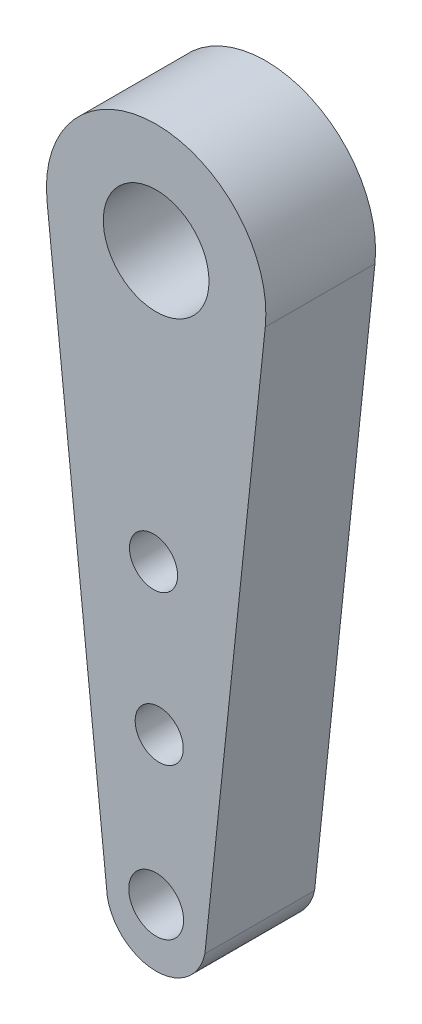
ISO-10303-21;
HEADER;
FILE_DESCRIPTION(('STEP AP214'),'2;1');
FILE_NAME('part.step','',(''),(''),'','','');
FILE_SCHEMA(('AUTOMOTIVE_DESIGN { 1 0 10303 214 1 1 1 1 }'));
ENDSEC;
DATA;
#1=APPLICATION_CONTEXT('core data for automotive mechanical design processes');
#2=APPLICATION_PROTOCOL_DEFINITION('international standard','automotive_design',2000,#1);
#3=PRODUCT_CONTEXT('',#1,'mechanical');
#4=PRODUCT('Part','Part','',(#3));
#5=PRODUCT_RELATED_PRODUCT_CATEGORY('part','',(#4));
#6=PRODUCT_DEFINITION_FORMATION('','',#4);
#7=PRODUCT_DEFINITION_CONTEXT('part definition',#1,'design');
#8=PRODUCT_DEFINITION('design','',#6,#7);
#9=PRODUCT_DEFINITION_SHAPE('','',#8);
#10=(LENGTH_UNIT() NAMED_UNIT(*) SI_UNIT(.MILLI.,.METRE.));
#11=(NAMED_UNIT(*) PLANE_ANGLE_UNIT() SI_UNIT($,.RADIAN.));
#12=(NAMED_UNIT(*) SI_UNIT($,.STERADIAN.) SOLID_ANGLE_UNIT());
#13=UNCERTAINTY_MEASURE_WITH_UNIT(LENGTH_MEASURE(1.E-05),#10,'distance_accuracy_value','');
#14=(GEOMETRIC_REPRESENTATION_CONTEXT(3) GLOBAL_UNCERTAINTY_ASSIGNED_CONTEXT((#13)) GLOBAL_UNIT_ASSIGNED_CONTEXT((#10,
#11,#12)) REPRESENTATION_CONTEXT('',''));
#15=CARTESIAN_POINT('',(0.,0.,0.));
#16=DIRECTION('',(0.,0.,1.));
#17=DIRECTION('',(1.,0.,0.));
#18=AXIS2_PLACEMENT_3D('',#15,#16,#17);
#19=CARTESIAN_POINT('',(1.34674465498423,-9.11924863651487,3.));
#20=DIRECTION('',(0.,0.,-1.));
#21=DIRECTION('',(-1.,0.,0.));
#22=AXIS2_PLACEMENT_3D('',#19,#20,#21);
#23=CYLINDRICAL_SURFACE('',#22,1.36292129602079);
#24=CARTESIAN_POINT('',(1.34674465498423,-9.11924863651487,0.));
#25=DIRECTION('',(0.,0.,1.));
#26=DIRECTION('',(1.,0.,0.));
#27=AXIS2_PLACEMENT_3D('',#24,#25,#26);
#28=CIRCLE('',#27,1.36292129602079);
#29=CARTESIAN_POINT('',(2.67974354077018,-9.40327051884153,0.));
#30=VERTEX_POINT('',#29);
#31=CARTESIAN_POINT('',(0.0137457691982582,-9.40327051884147,0.));
#32=VERTEX_POINT('',#31);
#33=EDGE_CURVE('E111',#30,#32,#28,.F.);
#34=ORIENTED_EDGE('',*,*,#33,.F.);
#35=DIRECTION('',(0.,0.,-1.));
#36=VECTOR('',#35,1.);
#37=CARTESIAN_POINT('',(2.67974354077018,-9.40327051884153,3.));
#38=LINE('',#37,#36);
#39=CARTESIAN_POINT('',(2.67974354077018,-9.40327051884153,3.));
#40=VERTEX_POINT('',#39);
#41=EDGE_CURVE('E11',#40,#30,#38,.T.);
#42=ORIENTED_EDGE('',*,*,#41,.F.);
#43=CARTESIAN_POINT('',(1.34674465498423,-9.11924863651487,3.));
#44=DIRECTION('',(0.,0.,1.));
#45=DIRECTION('',(1.,0.,0.));
#46=AXIS2_PLACEMENT_3D('',#43,#44,#45);
#47=CIRCLE('',#46,1.36292129602079);
#48=CARTESIAN_POINT('',(0.0137457691982582,-9.40327051884147,3.));
#49=VERTEX_POINT('',#48);
#50=EDGE_CURVE('E101',#40,#49,#47,.F.);
#51=ORIENTED_EDGE('',*,*,#50,.T.);
#52=DIRECTION('',(0.,0.,-1.));
#53=VECTOR('',#52,1.);
#54=CARTESIAN_POINT('',(0.0137457691982582,-9.40327051884147,3.));
#55=LINE('',#54,#53);
#56=EDGE_CURVE('E79',#49,#32,#55,.T.);
#57=ORIENTED_EDGE('',*,*,#56,.T.);
#58=EDGE_LOOP('',(#34,#42,#51,#57));
#59=FACE_BOUND('',#58,.T.);
#60=ADVANCED_FACE('F38',(#59),#23,.T.);
#61=CARTESIAN_POINT('',(3.63011030618815,-0.382441130555278,3.));
#62=DIRECTION('',(0.994496200731016,-0.104772643049482,0.));
#63=DIRECTION('',(0.104772643049482,0.994496200731016,0.));
#64=AXIS2_PLACEMENT_3D('',#61,#62,#63);
#65=PLANE('',#64);
#66=DIRECTION('',(-0.104772643049482,-0.994496200731016,0.));
#67=VECTOR('',#66,1.);
#68=CARTESIAN_POINT('',(3.63011030618815,-0.382441130555278,0.));
#69=LINE('',#68,#67);
#70=CARTESIAN_POINT('',(4.33023325717729,6.26308765002964,0.));
#71=VERTEX_POINT('',#70);
#72=EDGE_CURVE('E91',#71,#30,#69,.T.);
#73=ORIENTED_EDGE('',*,*,#72,.F.);
#74=DIRECTION('',(0.,0.,-1.));
#75=VECTOR('',#74,1.);
#76=CARTESIAN_POINT('',(4.33023325717729,6.26308765002964,3.));
#77=LINE('',#76,#75);
#78=CARTESIAN_POINT('',(4.33023325717729,6.26308765002964,3.));
#79=VERTEX_POINT('',#78);
#80=EDGE_CURVE('E48',#79,#71,#77,.T.);
#81=ORIENTED_EDGE('',*,*,#80,.F.);
#82=DIRECTION('',(-0.104772643049482,-0.994496200731016,0.));
#83=VECTOR('',#82,1.);
#84=CARTESIAN_POINT('',(3.63011030618815,-0.382441130555278,3.));
#85=LINE('',#84,#83);
#86=EDGE_CURVE('E89',#79,#40,#85,.T.);
#87=ORIENTED_EDGE('',*,*,#86,.T.);
#88=ORIENTED_EDGE('',*,*,#41,.T.);
#89=EDGE_LOOP('',(#73,#81,#87,#88));
#90=FACE_BOUND('',#89,.T.);
#91=ADVANCED_FACE('F87',(#90),#65,.T.);
#92=CARTESIAN_POINT('',(1.34674465498424,6.57740557917809,3.));
#93=DIRECTION('',(0.,0.,-1.));
#94=DIRECTION('',(-1.,0.,0.));
#95=AXIS2_PLACEMENT_3D('',#92,#93,#94);
#96=CYLINDRICAL_SURFACE('',#95,3.);
#97=CARTESIAN_POINT('',(1.34674465498424,6.57740557917809,0.));
#98=DIRECTION('',(0.,0.,1.));
#99=DIRECTION('',(1.,0.,0.));
#100=AXIS2_PLACEMENT_3D('',#97,#98,#99);
#101=CIRCLE('',#100,3.);
#102=CARTESIAN_POINT('',(-1.63674394720881,6.26308765002965,0.));
#103=VERTEX_POINT('',#102);
#104=EDGE_CURVE('E114',#71,#103,#101,.T.);
#105=ORIENTED_EDGE('',*,*,#104,.T.);
#106=DIRECTION('',(0.,0.,-1.));
#107=VECTOR('',#106,1.);
#108=CARTESIAN_POINT('',(-1.63674394720881,6.26308765002965,3.));
#109=LINE('',#108,#107);
#110=CARTESIAN_POINT('',(-1.63674394720881,6.26308765002965,3.));
#111=VERTEX_POINT('',#110);
#112=EDGE_CURVE('E94',#111,#103,#109,.T.);
#113=ORIENTED_EDGE('',*,*,#112,.F.);
#114=CARTESIAN_POINT('',(1.34674465498424,6.57740557917809,3.));
#115=DIRECTION('',(0.,0.,1.));
#116=DIRECTION('',(1.,0.,0.));
#117=AXIS2_PLACEMENT_3D('',#114,#115,#116);
#118=CIRCLE('',#117,3.);
#119=EDGE_CURVE('E97',#79,#111,#118,.T.);
#120=ORIENTED_EDGE('',*,*,#119,.F.);
#121=ORIENTED_EDGE('',*,*,#80,.T.);
#122=EDGE_LOOP('',(#105,#113,#120,#121));
#123=FACE_BOUND('',#122,.T.);
#124=ADVANCED_FACE('F98',(#123),#96,.T.);
#125=CARTESIAN_POINT('',(1.34674465498424,6.57740557917809,3.));
#126=DIRECTION('',(0.,0.,-1.));
#127=DIRECTION('',(-1.,0.,0.));
#128=AXIS2_PLACEMENT_3D('',#125,#126,#127);
#129=CYLINDRICAL_SURFACE('',#128,1.44530488894308);
#130=CARTESIAN_POINT('',(1.34674465498424,6.57740557917809,3.));
#131=DIRECTION('',(0.,0.,1.));
#132=DIRECTION('',(1.,0.,0.));
#133=AXIS2_PLACEMENT_3D('',#130,#131,#132);
#134=CIRCLE('',#133,1.44530488894308);
#135=CARTESIAN_POINT('',(2.79204954392732,6.57740557917809,3.));
#136=VERTEX_POINT('',#135);
#137=EDGE_CURVE('E103',#136,#136,#134,.T.);
#138=ORIENTED_EDGE('',*,*,#137,.T.);
#139=EDGE_LOOP('',(#138));
#140=FACE_BOUND('',#139,.T.);
#141=CARTESIAN_POINT('',(1.34674465498424,6.57740557917809,0.));
#142=DIRECTION('',(0.,0.,1.));
#143=DIRECTION('',(1.,0.,0.));
#144=AXIS2_PLACEMENT_3D('',#141,#142,#143);
#145=CIRCLE('',#144,1.44530488894308);
#146=CARTESIAN_POINT('',(2.79204954392732,6.57740557917809,0.));
#147=VERTEX_POINT('',#146);
#148=EDGE_CURVE('E108',#147,#147,#145,.T.);
#149=ORIENTED_EDGE('',*,*,#148,.F.);
#150=EDGE_LOOP('',(#149));
#151=FACE_BOUND('',#150,.T.);
#152=ADVANCED_FACE('F40',(#140,#151),#129,.F.);
#153=CARTESIAN_POINT('',(-0.966188254553424,-0.101790330660404,3.));
#154=DIRECTION('',(0.994496200731016,0.10477264304948,0.));
#155=DIRECTION('',(-0.10477264304948,0.994496200731017,0.));
#156=AXIS2_PLACEMENT_3D('',#153,#154,#155);
#157=PLANE('',#156);
#158=DIRECTION('',(0.10477264304948,-0.994496200731017,0.));
#159=VECTOR('',#158,1.);
#160=CARTESIAN_POINT('',(-0.966188254553424,-0.101790330660404,0.));
#161=LINE('',#160,#159);
#162=EDGE_CURVE('E72',#103,#32,#161,.T.);
#163=ORIENTED_EDGE('',*,*,#162,.T.);
#164=ORIENTED_EDGE('',*,*,#56,.F.);
#165=DIRECTION('',(0.10477264304948,-0.994496200731017,0.));
#166=VECTOR('',#165,1.);
#167=CARTESIAN_POINT('',(-0.966188254553424,-0.101790330660404,3.));
#168=LINE('',#167,#166);
#169=EDGE_CURVE('E56',#111,#49,#168,.T.);
#170=ORIENTED_EDGE('',*,*,#169,.F.);
#171=ORIENTED_EDGE('',*,*,#112,.T.);
#172=EDGE_LOOP('',(#163,#164,#170,#171));
#173=FACE_BOUND('',#172,.T.);
#174=ADVANCED_FACE('F119',(#173),#157,.F.);
#175=CARTESIAN_POINT('',(0.,0.,3.));
#176=DIRECTION('',(0.,0.,1.));
#177=DIRECTION('',(1.,0.,0.));
#178=AXIS2_PLACEMENT_3D('',#175,#176,#177);
#179=PLANE('',#178);
#180=CARTESIAN_POINT('',(1.43062658039233,-4.83717095114532,3.));
#181=DIRECTION('',(0.,0.,-1.));
#182=DIRECTION('',(-1.,0.,0.));
#183=AXIS2_PLACEMENT_3D('',#180,#181,#182);
#184=CIRCLE('',#183,0.657732984992645);
#185=CARTESIAN_POINT('',(0.772893595399688,-4.83717095114532,3.));
#186=VERTEX_POINT('',#185);
#187=EDGE_CURVE('E153',#186,#186,#184,.T.);
#188=ORIENTED_EDGE('',*,*,#187,.T.);
#189=EDGE_LOOP('',(#188));
#190=FACE_BOUND('',#189,.T.);
#191=CARTESIAN_POINT('',(1.27535972335455,-0.820045285492267,3.));
#192=DIRECTION('',(0.,0.,-1.));
#193=DIRECTION('',(-1.,0.,0.));
#194=AXIS2_PLACEMENT_3D('',#191,#192,#193);
#195=CIRCLE('',#194,0.657732984992645);
#196=CARTESIAN_POINT('',(0.61762673836191,-0.820045285492267,3.));
#197=VERTEX_POINT('',#196);
#198=EDGE_CURVE('E161',#197,#197,#195,.T.);
#199=ORIENTED_EDGE('',*,*,#198,.T.);
#200=EDGE_LOOP('',(#199));
#201=FACE_BOUND('',#200,.T.);
#202=CARTESIAN_POINT('',(1.34674465498424,-8.90310392814271,3.));
#203=DIRECTION('',(0.,0.,1.));
#204=DIRECTION('',(1.,0.,0.));
#205=AXIS2_PLACEMENT_3D('',#202,#203,#204);
#206=CIRCLE('',#205,0.75);
#207=CARTESIAN_POINT('',(2.09674465498424,-8.90310392814271,3.));
#208=VERTEX_POINT('',#207);
#209=EDGE_CURVE('E164',#208,#208,#206,.T.);
#210=ORIENTED_EDGE('',*,*,#209,.F.);
#211=EDGE_LOOP('',(#210));
#212=FACE_BOUND('',#211,.T.);
#213=ORIENTED_EDGE('',*,*,#137,.F.);
#214=EDGE_LOOP('',(#213));
#215=FACE_BOUND('',#214,.T.);
#216=ORIENTED_EDGE('',*,*,#50,.F.);
#217=ORIENTED_EDGE('',*,*,#86,.F.);
#218=ORIENTED_EDGE('',*,*,#119,.T.);
#219=ORIENTED_EDGE('',*,*,#169,.T.);
#220=EDGE_LOOP('',(#216,#217,#218,#219));
#221=FACE_BOUND('',#220,.T.);
#222=ADVANCED_FACE('F100',(#190,#201,#212,#215,#221),#179,.T.);
#223=CARTESIAN_POINT('',(0.,0.,0.));
#224=DIRECTION('',(0.,0.,1.));
#225=DIRECTION('',(1.,0.,0.));
#226=AXIS2_PLACEMENT_3D('',#223,#224,#225);
#227=PLANE('',#226);
#228=CARTESIAN_POINT('',(1.43062658039233,-4.83717095114532,0.));
#229=DIRECTION('',(0.,0.,-1.));
#230=DIRECTION('',(-1.,0.,0.));
#231=AXIS2_PLACEMENT_3D('',#228,#229,#230);
#232=CIRCLE('',#231,0.657732984992645);
#233=CARTESIAN_POINT('',(0.772893595399688,-4.83717095114532,0.));
#234=VERTEX_POINT('',#233);
#235=EDGE_CURVE('E156',#234,#234,#232,.T.);
#236=ORIENTED_EDGE('',*,*,#235,.F.);
#237=EDGE_LOOP('',(#236));
#238=FACE_BOUND('',#237,.T.);
#239=CARTESIAN_POINT('',(1.27535972335455,-0.820045285492267,0.));
#240=DIRECTION('',(0.,0.,-1.));
#241=DIRECTION('',(-1.,0.,0.));
#242=AXIS2_PLACEMENT_3D('',#239,#240,#241);
#243=CIRCLE('',#242,0.657732984992645);
#244=CARTESIAN_POINT('',(0.61762673836191,-0.820045285492267,0.));
#245=VERTEX_POINT('',#244);
#246=EDGE_CURVE('E158',#245,#245,#243,.T.);
#247=ORIENTED_EDGE('',*,*,#246,.F.);
#248=EDGE_LOOP('',(#247));
#249=FACE_BOUND('',#248,.T.);
#250=CARTESIAN_POINT('',(1.34674465498424,-8.90310392814271,0.));
#251=DIRECTION('',(0.,0.,1.));
#252=DIRECTION('',(1.,0.,0.));
#253=AXIS2_PLACEMENT_3D('',#250,#251,#252);
#254=CIRCLE('',#253,0.75);
#255=CARTESIAN_POINT('',(2.09674465498424,-8.90310392814271,0.));
#256=VERTEX_POINT('',#255);
#257=EDGE_CURVE('E42',#256,#256,#254,.T.);
#258=ORIENTED_EDGE('',*,*,#257,.T.);
#259=EDGE_LOOP('',(#258));
#260=FACE_BOUND('',#259,.T.);
#261=ORIENTED_EDGE('',*,*,#148,.T.);
#262=EDGE_LOOP('',(#261));
#263=FACE_BOUND('',#262,.T.);
#264=ORIENTED_EDGE('',*,*,#33,.T.);
#265=ORIENTED_EDGE('',*,*,#162,.F.);
#266=ORIENTED_EDGE('',*,*,#104,.F.);
#267=ORIENTED_EDGE('',*,*,#72,.T.);
#268=EDGE_LOOP('',(#264,#265,#266,#267));
#269=FACE_BOUND('',#268,.T.);
#270=ADVANCED_FACE('F120',(#238,#249,#260,#263,#269),#227,.F.);
#271=CARTESIAN_POINT('',(1.34674465498424,-8.90310392814271,-7.));
#272=DIRECTION('',(0.,0.,1.));
#273=DIRECTION('',(1.,0.,0.));
#274=AXIS2_PLACEMENT_3D('',#271,#272,#273);
#275=CYLINDRICAL_SURFACE('',#274,0.75);
#276=ORIENTED_EDGE('',*,*,#209,.T.);
#277=EDGE_LOOP('',(#276));
#278=FACE_BOUND('',#277,.T.);
#279=ORIENTED_EDGE('',*,*,#257,.F.);
#280=EDGE_LOOP('',(#279));
#281=FACE_BOUND('',#280,.T.);
#282=ADVANCED_FACE('F133',(#278,#281),#275,.F.);
#283=CARTESIAN_POINT('',(1.27535972335455,-0.820045285492267,3.));
#284=DIRECTION('',(0.,0.,-1.));
#285=DIRECTION('',(-1.,0.,0.));
#286=AXIS2_PLACEMENT_3D('',#283,#284,#285);
#287=CYLINDRICAL_SURFACE('',#286,0.657732984992645);
#288=ORIENTED_EDGE('',*,*,#198,.F.);
#289=EDGE_LOOP('',(#288));
#290=FACE_BOUND('',#289,.T.);
#291=ORIENTED_EDGE('',*,*,#246,.T.);
#292=EDGE_LOOP('',(#291));
#293=FACE_BOUND('',#292,.T.);
#294=ADVANCED_FACE('F140',(#290,#293),#287,.F.);
#295=CARTESIAN_POINT('',(1.43062658039233,-4.83717095114532,3.));
#296=DIRECTION('',(0.,0.,-1.));
#297=DIRECTION('',(-1.,0.,0.));
#298=AXIS2_PLACEMENT_3D('',#295,#296,#297);
#299=CYLINDRICAL_SURFACE('',#298,0.657732984992645);
#300=ORIENTED_EDGE('',*,*,#187,.F.);
#301=EDGE_LOOP('',(#300));
#302=FACE_BOUND('',#301,.T.);
#303=ORIENTED_EDGE('',*,*,#235,.T.);
#304=EDGE_LOOP('',(#303));
#305=FACE_BOUND('',#304,.T.);
#306=ADVANCED_FACE('F144',(#302,#305),#299,.F.);
#307=CLOSED_SHELL('',(#60,#91,#124,#152,#174,#222,#270,#282,#294,#306));
#308=MANIFOLD_SOLID_BREP('B2',#307);
#309=ADVANCED_BREP_SHAPE_REPRESENTATION('',(#18,#308),#14);
#310=SHAPE_DEFINITION_REPRESENTATION(#9,#309);
ENDSEC;
END-ISO-10303-21;
